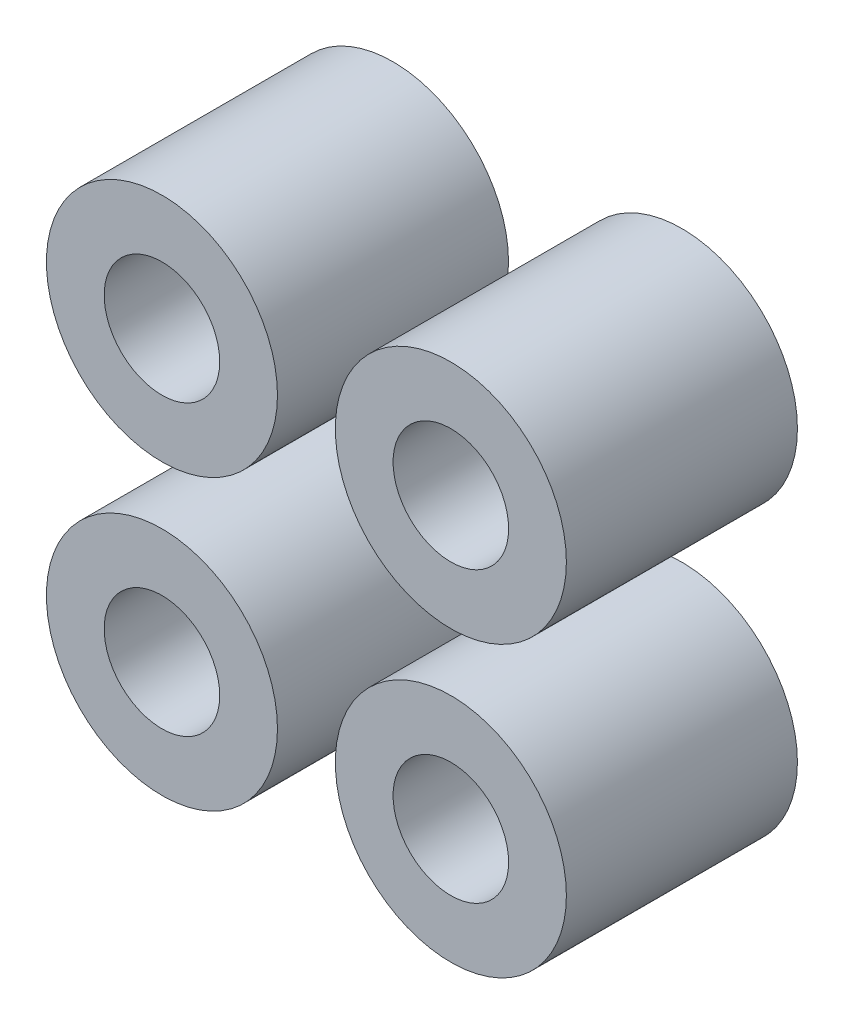
ISO-10303-21;
HEADER;
FILE_DESCRIPTION(('STEP AP214'),'2;1');
FILE_NAME('part.step','',(''),(''),'','','');
FILE_SCHEMA(('AUTOMOTIVE_DESIGN { 1 0 10303 214 1 1 1 1 }'));
ENDSEC;
DATA;
#1=APPLICATION_CONTEXT('core data for automotive mechanical design processes');
#2=APPLICATION_PROTOCOL_DEFINITION('international standard','automotive_design',2000,#1);
#3=PRODUCT_CONTEXT('',#1,'mechanical');
#4=PRODUCT('Part','Part','',(#3));
#5=PRODUCT_RELATED_PRODUCT_CATEGORY('part','',(#4));
#6=PRODUCT_DEFINITION_FORMATION('','',#4);
#7=PRODUCT_DEFINITION_CONTEXT('part definition',#1,'design');
#8=PRODUCT_DEFINITION('design','',#6,#7);
#9=PRODUCT_DEFINITION_SHAPE('','',#8);
#10=(LENGTH_UNIT() NAMED_UNIT(*) SI_UNIT(.MILLI.,.METRE.));
#11=(NAMED_UNIT(*) PLANE_ANGLE_UNIT() SI_UNIT($,.RADIAN.));
#12=(NAMED_UNIT(*) SI_UNIT($,.STERADIAN.) SOLID_ANGLE_UNIT());
#13=UNCERTAINTY_MEASURE_WITH_UNIT(LENGTH_MEASURE(1.E-05),#10,'distance_accuracy_value','');
#14=(GEOMETRIC_REPRESENTATION_CONTEXT(3) GLOBAL_UNCERTAINTY_ASSIGNED_CONTEXT((#13)) GLOBAL_UNIT_ASSIGNED_CONTEXT((#10,
#11,#12)) REPRESENTATION_CONTEXT('',''));
#15=CARTESIAN_POINT('',(0.,0.,0.));
#16=DIRECTION('',(0.,0.,1.));
#17=DIRECTION('',(1.,0.,0.));
#18=AXIS2_PLACEMENT_3D('',#15,#16,#17);
#19=CARTESIAN_POINT('',(-3.75120147419467,-3.75120147419459,6.));
#20=DIRECTION('',(0.,0.,1.));
#21=DIRECTION('',(1.,0.,0.));
#22=AXIS2_PLACEMENT_3D('',#19,#20,#21);
#23=PLANE('',#22);
#24=CARTESIAN_POINT('',(-3.75120147419467,-3.75120147419459,6.));
#25=DIRECTION('',(0.,0.,1.));
#26=DIRECTION('',(1.,0.,0.));
#27=AXIS2_PLACEMENT_3D('',#24,#25,#26);
#28=CIRCLE('',#27,3.);
#29=CARTESIAN_POINT('',(-0.751201474194675,-3.75120147419459,6.));
#30=VERTEX_POINT('',#29);
#31=EDGE_CURVE('E65',#30,#30,#28,.T.);
#32=ORIENTED_EDGE('',*,*,#31,.T.);
#33=EDGE_LOOP('',(#32));
#34=FACE_BOUND('',#33,.T.);
#35=CARTESIAN_POINT('',(-3.75120147419467,-3.75120147419459,6.));
#36=DIRECTION('',(0.,0.,1.));
#37=DIRECTION('',(1.,0.,0.));
#38=AXIS2_PLACEMENT_3D('',#35,#36,#37);
#39=CIRCLE('',#38,1.5);
#40=CARTESIAN_POINT('',(-2.25120147419468,-3.75120147419459,6.));
#41=VERTEX_POINT('',#40);
#42=EDGE_CURVE('E56',#41,#41,#39,.T.);
#43=ORIENTED_EDGE('',*,*,#42,.F.);
#44=EDGE_LOOP('',(#43));
#45=FACE_BOUND('',#44,.T.);
#46=ADVANCED_FACE('F52',(#34,#45),#23,.T.);
#47=CARTESIAN_POINT('',(-3.75120147419467,-3.75120147419459,0.));
#48=DIRECTION('',(0.,0.,1.));
#49=DIRECTION('',(1.,0.,0.));
#50=AXIS2_PLACEMENT_3D('',#47,#48,#49);
#51=PLANE('',#50);
#52=CARTESIAN_POINT('',(-3.75120147419467,-3.75120147419459,0.));
#53=DIRECTION('',(0.,0.,1.));
#54=DIRECTION('',(1.,0.,0.));
#55=AXIS2_PLACEMENT_3D('',#52,#53,#54);
#56=CIRCLE('',#55,3.);
#57=CARTESIAN_POINT('',(-0.751201474194675,-3.75120147419459,0.));
#58=VERTEX_POINT('',#57);
#59=EDGE_CURVE('E63',#58,#58,#56,.T.);
#60=ORIENTED_EDGE('',*,*,#59,.F.);
#61=EDGE_LOOP('',(#60));
#62=FACE_BOUND('',#61,.T.);
#63=CARTESIAN_POINT('',(-3.75120147419467,-3.75120147419459,0.));
#64=DIRECTION('',(0.,0.,1.));
#65=DIRECTION('',(1.,0.,0.));
#66=AXIS2_PLACEMENT_3D('',#63,#64,#65);
#67=CIRCLE('',#66,1.5);
#68=CARTESIAN_POINT('',(-2.25120147419468,-3.75120147419459,0.));
#69=VERTEX_POINT('',#68);
#70=EDGE_CURVE('E11',#69,#69,#67,.T.);
#71=ORIENTED_EDGE('',*,*,#70,.T.);
#72=EDGE_LOOP('',(#71));
#73=FACE_BOUND('',#72,.T.);
#74=ADVANCED_FACE('F73',(#62,#73),#51,.F.);
#75=CARTESIAN_POINT('',(-3.75120147419467,-3.75120147419459,6.));
#76=DIRECTION('',(0.,0.,-1.));
#77=DIRECTION('',(-1.,0.,0.));
#78=AXIS2_PLACEMENT_3D('',#75,#76,#77);
#79=CYLINDRICAL_SURFACE('',#78,3.);
#80=ORIENTED_EDGE('',*,*,#31,.F.);
#81=EDGE_LOOP('',(#80));
#82=FACE_BOUND('',#81,.T.);
#83=ORIENTED_EDGE('',*,*,#59,.T.);
#84=EDGE_LOOP('',(#83));
#85=FACE_BOUND('',#84,.T.);
#86=ADVANCED_FACE('F71',(#82,#85),#79,.T.);
#87=CARTESIAN_POINT('',(-3.75120147419467,-3.75120147419459,6.));
#88=DIRECTION('',(0.,0.,-1.));
#89=DIRECTION('',(-1.,0.,0.));
#90=AXIS2_PLACEMENT_3D('',#87,#88,#89);
#91=CYLINDRICAL_SURFACE('',#90,1.5);
#92=ORIENTED_EDGE('',*,*,#42,.T.);
#93=EDGE_LOOP('',(#92));
#94=FACE_BOUND('',#93,.T.);
#95=ORIENTED_EDGE('',*,*,#70,.F.);
#96=EDGE_LOOP('',(#95));
#97=FACE_BOUND('',#96,.T.);
#98=ADVANCED_FACE('F54',(#94,#97),#91,.F.);
#99=CLOSED_SHELL('',(#46,#74,#86,#98));
#100=MANIFOLD_SOLID_BREP('B2',#99);
#101=CARTESIAN_POINT('',(3.75120147419461,-3.75120147419466,6.));
#102=DIRECTION('',(0.,0.,1.));
#103=DIRECTION('',(1.,0.,0.));
#104=AXIS2_PLACEMENT_3D('',#101,#102,#103);
#105=PLANE('',#104);
#106=CARTESIAN_POINT('',(3.75120147419461,-3.75120147419466,6.));
#107=DIRECTION('',(0.,0.,1.));
#108=DIRECTION('',(1.,0.,0.));
#109=AXIS2_PLACEMENT_3D('',#106,#107,#108);
#110=CIRCLE('',#109,3.);
#111=CARTESIAN_POINT('',(6.75120147419461,-3.75120147419466,6.));
#112=VERTEX_POINT('',#111);
#113=EDGE_CURVE('E135',#112,#112,#110,.T.);
#114=ORIENTED_EDGE('',*,*,#113,.T.);
#115=EDGE_LOOP('',(#114));
#116=FACE_BOUND('',#115,.T.);
#117=CARTESIAN_POINT('',(3.75120147419461,-3.75120147419466,6.));
#118=DIRECTION('',(0.,0.,1.));
#119=DIRECTION('',(1.,0.,0.));
#120=AXIS2_PLACEMENT_3D('',#117,#118,#119);
#121=CIRCLE('',#120,1.5);
#122=CARTESIAN_POINT('',(5.25120147419461,-3.75120147419466,6.));
#123=VERTEX_POINT('',#122);
#124=EDGE_CURVE('E126',#123,#123,#121,.T.);
#125=ORIENTED_EDGE('',*,*,#124,.F.);
#126=EDGE_LOOP('',(#125));
#127=FACE_BOUND('',#126,.T.);
#128=ADVANCED_FACE('F122',(#116,#127),#105,.T.);
#129=CARTESIAN_POINT('',(3.75120147419461,-3.75120147419466,0.));
#130=DIRECTION('',(0.,0.,1.));
#131=DIRECTION('',(1.,0.,0.));
#132=AXIS2_PLACEMENT_3D('',#129,#130,#131);
#133=PLANE('',#132);
#134=CARTESIAN_POINT('',(3.75120147419461,-3.75120147419466,0.));
#135=DIRECTION('',(0.,0.,1.));
#136=DIRECTION('',(1.,0.,0.));
#137=AXIS2_PLACEMENT_3D('',#134,#135,#136);
#138=CIRCLE('',#137,3.);
#139=CARTESIAN_POINT('',(6.75120147419461,-3.75120147419466,0.));
#140=VERTEX_POINT('',#139);
#141=EDGE_CURVE('E133',#140,#140,#138,.T.);
#142=ORIENTED_EDGE('',*,*,#141,.F.);
#143=EDGE_LOOP('',(#142));
#144=FACE_BOUND('',#143,.T.);
#145=CARTESIAN_POINT('',(3.75120147419461,-3.75120147419466,0.));
#146=DIRECTION('',(0.,0.,1.));
#147=DIRECTION('',(1.,0.,0.));
#148=AXIS2_PLACEMENT_3D('',#145,#146,#147);
#149=CIRCLE('',#148,1.5);
#150=CARTESIAN_POINT('',(5.25120147419461,-3.75120147419466,0.));
#151=VERTEX_POINT('',#150);
#152=EDGE_CURVE('E51',#151,#151,#149,.T.);
#153=ORIENTED_EDGE('',*,*,#152,.T.);
#154=EDGE_LOOP('',(#153));
#155=FACE_BOUND('',#154,.T.);
#156=ADVANCED_FACE('F143',(#144,#155),#133,.F.);
#157=CARTESIAN_POINT('',(3.75120147419461,-3.75120147419466,6.));
#158=DIRECTION('',(0.,0.,-1.));
#159=DIRECTION('',(-1.,0.,0.));
#160=AXIS2_PLACEMENT_3D('',#157,#158,#159);
#161=CYLINDRICAL_SURFACE('',#160,3.);
#162=ORIENTED_EDGE('',*,*,#113,.F.);
#163=EDGE_LOOP('',(#162));
#164=FACE_BOUND('',#163,.T.);
#165=ORIENTED_EDGE('',*,*,#141,.T.);
#166=EDGE_LOOP('',(#165));
#167=FACE_BOUND('',#166,.T.);
#168=ADVANCED_FACE('F141',(#164,#167),#161,.T.);
#169=CARTESIAN_POINT('',(3.75120147419461,-3.75120147419466,6.));
#170=DIRECTION('',(0.,0.,-1.));
#171=DIRECTION('',(-1.,0.,0.));
#172=AXIS2_PLACEMENT_3D('',#169,#170,#171);
#173=CYLINDRICAL_SURFACE('',#172,1.5);
#174=ORIENTED_EDGE('',*,*,#124,.T.);
#175=EDGE_LOOP('',(#174));
#176=FACE_BOUND('',#175,.T.);
#177=ORIENTED_EDGE('',*,*,#152,.F.);
#178=EDGE_LOOP('',(#177));
#179=FACE_BOUND('',#178,.T.);
#180=ADVANCED_FACE('F124',(#176,#179),#173,.F.);
#181=CLOSED_SHELL('',(#128,#156,#168,#180));
#182=MANIFOLD_SOLID_BREP('B6',#181);
#183=CARTESIAN_POINT('',(3.75120147419465,3.75120147419462,6.));
#184=DIRECTION('',(0.,0.,1.));
#185=DIRECTION('',(1.,0.,0.));
#186=AXIS2_PLACEMENT_3D('',#183,#184,#185);
#187=PLANE('',#186);
#188=CARTESIAN_POINT('',(3.75120147419465,3.75120147419462,6.));
#189=DIRECTION('',(0.,0.,1.));
#190=DIRECTION('',(1.,0.,0.));
#191=AXIS2_PLACEMENT_3D('',#188,#189,#190);
#192=CIRCLE('',#191,3.);
#193=CARTESIAN_POINT('',(6.75120147419465,3.75120147419462,6.));
#194=VERTEX_POINT('',#193);
#195=EDGE_CURVE('E206',#194,#194,#192,.T.);
#196=ORIENTED_EDGE('',*,*,#195,.T.);
#197=EDGE_LOOP('',(#196));
#198=FACE_BOUND('',#197,.T.);
#199=CARTESIAN_POINT('',(3.75120147419465,3.75120147419462,6.));
#200=DIRECTION('',(0.,0.,1.));
#201=DIRECTION('',(1.,0.,0.));
#202=AXIS2_PLACEMENT_3D('',#199,#200,#201);
#203=CIRCLE('',#202,1.5);
#204=CARTESIAN_POINT('',(5.25120147419465,3.75120147419462,6.));
#205=VERTEX_POINT('',#204);
#206=EDGE_CURVE('E195',#205,#205,#203,.T.);
#207=ORIENTED_EDGE('',*,*,#206,.F.);
#208=EDGE_LOOP('',(#207));
#209=FACE_BOUND('',#208,.T.);
#210=ADVANCED_FACE('F191',(#198,#209),#187,.T.);
#211=CARTESIAN_POINT('',(3.75120147419465,3.75120147419462,0.));
#212=DIRECTION('',(0.,0.,1.));
#213=DIRECTION('',(1.,0.,0.));
#214=AXIS2_PLACEMENT_3D('',#211,#212,#213);
#215=PLANE('',#214);
#216=CARTESIAN_POINT('',(3.75120147419465,3.75120147419462,0.));
#217=DIRECTION('',(0.,0.,1.));
#218=DIRECTION('',(1.,0.,0.));
#219=AXIS2_PLACEMENT_3D('',#216,#217,#218);
#220=CIRCLE('',#219,3.);
#221=CARTESIAN_POINT('',(6.75120147419465,3.75120147419462,0.));
#222=VERTEX_POINT('',#221);
#223=EDGE_CURVE('E204',#222,#222,#220,.T.);
#224=ORIENTED_EDGE('',*,*,#223,.F.);
#225=EDGE_LOOP('',(#224));
#226=FACE_BOUND('',#225,.T.);
#227=CARTESIAN_POINT('',(3.75120147419465,3.75120147419462,0.));
#228=DIRECTION('',(0.,0.,1.));
#229=DIRECTION('',(1.,0.,0.));
#230=AXIS2_PLACEMENT_3D('',#227,#228,#229);
#231=CIRCLE('',#230,1.5);
#232=CARTESIAN_POINT('',(5.25120147419465,3.75120147419462,0.));
#233=VERTEX_POINT('',#232);
#234=EDGE_CURVE('E121',#233,#233,#231,.T.);
#235=ORIENTED_EDGE('',*,*,#234,.T.);
#236=EDGE_LOOP('',(#235));
#237=FACE_BOUND('',#236,.T.);
#238=ADVANCED_FACE('F216',(#226,#237),#215,.F.);
#239=CARTESIAN_POINT('',(3.75120147419465,3.75120147419462,6.));
#240=DIRECTION('',(0.,0.,-1.));
#241=DIRECTION('',(-1.,0.,0.));
#242=AXIS2_PLACEMENT_3D('',#239,#240,#241);
#243=CYLINDRICAL_SURFACE('',#242,3.);
#244=ORIENTED_EDGE('',*,*,#195,.F.);
#245=EDGE_LOOP('',(#244));
#246=FACE_BOUND('',#245,.T.);
#247=ORIENTED_EDGE('',*,*,#223,.T.);
#248=EDGE_LOOP('',(#247));
#249=FACE_BOUND('',#248,.T.);
#250=ADVANCED_FACE('F214',(#246,#249),#243,.T.);
#251=CARTESIAN_POINT('',(3.75120147419465,3.75120147419462,6.));
#252=DIRECTION('',(0.,0.,-1.));
#253=DIRECTION('',(-1.,0.,0.));
#254=AXIS2_PLACEMENT_3D('',#251,#252,#253);
#255=CYLINDRICAL_SURFACE('',#254,1.5);
#256=ORIENTED_EDGE('',*,*,#206,.T.);
#257=EDGE_LOOP('',(#256));
#258=FACE_BOUND('',#257,.T.);
#259=ORIENTED_EDGE('',*,*,#234,.F.);
#260=EDGE_LOOP('',(#259));
#261=FACE_BOUND('',#260,.T.);
#262=ADVANCED_FACE('F193',(#258,#261),#255,.F.);
#263=CLOSED_SHELL('',(#210,#238,#250,#262));
#264=MANIFOLD_SOLID_BREP('B46',#263);
#265=CARTESIAN_POINT('',(-3.75120147419463,3.75120147419463,6.));
#266=DIRECTION('',(0.,0.,1.));
#267=DIRECTION('',(1.,0.,0.));
#268=AXIS2_PLACEMENT_3D('',#265,#266,#267);
#269=PLANE('',#268);
#270=CARTESIAN_POINT('',(-3.75120147419463,3.75120147419463,6.));
#271=DIRECTION('',(0.,0.,1.));
#272=DIRECTION('',(1.,0.,0.));
#273=AXIS2_PLACEMENT_3D('',#270,#271,#272);
#274=CIRCLE('',#273,3.);
#275=CARTESIAN_POINT('',(-0.751201474194635,3.75120147419463,6.));
#276=VERTEX_POINT('',#275);
#277=EDGE_CURVE('E190',#276,#276,#274,.T.);
#278=ORIENTED_EDGE('',*,*,#277,.T.);
#279=EDGE_LOOP('',(#278));
#280=FACE_BOUND('',#279,.T.);
#281=CARTESIAN_POINT('',(-3.75120147419463,3.75120147419463,6.));
#282=DIRECTION('',(0.,0.,1.));
#283=DIRECTION('',(1.,0.,0.));
#284=AXIS2_PLACEMENT_3D('',#281,#282,#283);
#285=CIRCLE('',#284,1.5);
#286=CARTESIAN_POINT('',(-2.25120147419464,3.75120147419463,6.));
#287=VERTEX_POINT('',#286);
#288=EDGE_CURVE('E268',#287,#287,#285,.T.);
#289=ORIENTED_EDGE('',*,*,#288,.F.);
#290=EDGE_LOOP('',(#289));
#291=FACE_BOUND('',#290,.T.);
#292=ADVANCED_FACE('F257',(#280,#291),#269,.T.);
#293=CARTESIAN_POINT('',(-3.75120147419463,3.75120147419463,0.));
#294=DIRECTION('',(0.,0.,1.));
#295=DIRECTION('',(1.,0.,0.));
#296=AXIS2_PLACEMENT_3D('',#293,#294,#295);
#297=PLANE('',#296);
#298=CARTESIAN_POINT('',(-3.75120147419463,3.75120147419463,0.));
#299=DIRECTION('',(0.,0.,1.));
#300=DIRECTION('',(1.,0.,0.));
#301=AXIS2_PLACEMENT_3D('',#298,#299,#300);
#302=CIRCLE('',#301,3.);
#303=CARTESIAN_POINT('',(-0.751201474194635,3.75120147419463,0.));
#304=VERTEX_POINT('',#303);
#305=EDGE_CURVE('E261',#304,#304,#302,.T.);
#306=ORIENTED_EDGE('',*,*,#305,.F.);
#307=EDGE_LOOP('',(#306));
#308=FACE_BOUND('',#307,.T.);
#309=CARTESIAN_POINT('',(-3.75120147419463,3.75120147419463,0.));
#310=DIRECTION('',(0.,0.,1.));
#311=DIRECTION('',(1.,0.,0.));
#312=AXIS2_PLACEMENT_3D('',#309,#310,#311);
#313=CIRCLE('',#312,1.5);
#314=CARTESIAN_POINT('',(-2.25120147419464,3.75120147419463,0.));
#315=VERTEX_POINT('',#314);
#316=EDGE_CURVE('E270',#315,#315,#313,.T.);
#317=ORIENTED_EDGE('',*,*,#316,.T.);
#318=EDGE_LOOP('',(#317));
#319=FACE_BOUND('',#318,.T.);
#320=ADVANCED_FACE('F280',(#308,#319),#297,.F.);
#321=CARTESIAN_POINT('',(-3.75120147419463,3.75120147419463,6.));
#322=DIRECTION('',(0.,0.,-1.));
#323=DIRECTION('',(-1.,0.,0.));
#324=AXIS2_PLACEMENT_3D('',#321,#322,#323);
#325=CYLINDRICAL_SURFACE('',#324,3.);
#326=ORIENTED_EDGE('',*,*,#277,.F.);
#327=EDGE_LOOP('',(#326));
#328=FACE_BOUND('',#327,.T.);
#329=ORIENTED_EDGE('',*,*,#305,.T.);
#330=EDGE_LOOP('',(#329));
#331=FACE_BOUND('',#330,.T.);
#332=ADVANCED_FACE('F259',(#328,#331),#325,.T.);
#333=CARTESIAN_POINT('',(-3.75120147419463,3.75120147419463,6.));
#334=DIRECTION('',(0.,0.,-1.));
#335=DIRECTION('',(-1.,0.,0.));
#336=AXIS2_PLACEMENT_3D('',#333,#334,#335);
#337=CYLINDRICAL_SURFACE('',#336,1.5);
#338=ORIENTED_EDGE('',*,*,#288,.T.);
#339=EDGE_LOOP('',(#338));
#340=FACE_BOUND('',#339,.T.);
#341=ORIENTED_EDGE('',*,*,#316,.F.);
#342=EDGE_LOOP('',(#341));
#343=FACE_BOUND('',#342,.T.);
#344=ADVANCED_FACE('F276',(#340,#343),#337,.F.);
#345=CLOSED_SHELL('',(#292,#320,#332,#344));
#346=MANIFOLD_SOLID_BREP('B116',#345);
#347=ADVANCED_BREP_SHAPE_REPRESENTATION('',(#18,#100,#182,#264,#346),#14);
#348=SHAPE_DEFINITION_REPRESENTATION(#9,#347);
ENDSEC;
END-ISO-10303-21;
